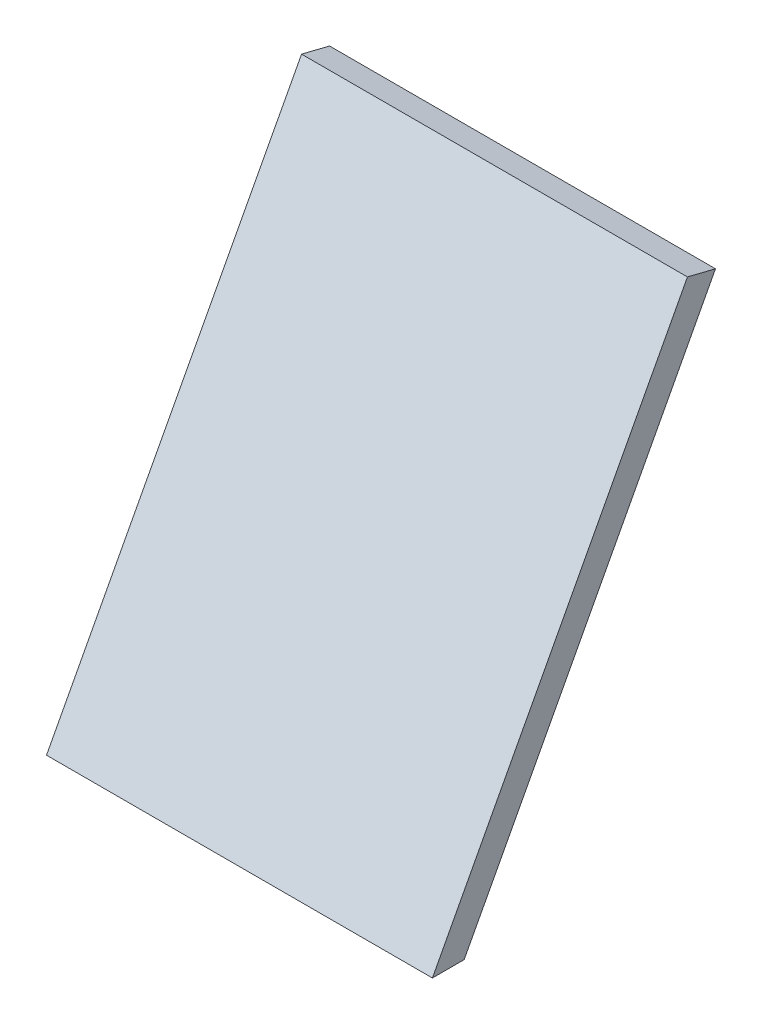
ISO-10303-21;
HEADER;
FILE_DESCRIPTION(('STEP AP214'),'2;1');
FILE_NAME('part.step','',(''),(''),'','','');
FILE_SCHEMA(('AUTOMOTIVE_DESIGN { 1 0 10303 214 1 1 1 1 }'));
ENDSEC;
DATA;
#1=APPLICATION_CONTEXT('core data for automotive mechanical design processes');
#2=APPLICATION_PROTOCOL_DEFINITION('international standard','automotive_design',2000,#1);
#3=PRODUCT_CONTEXT('',#1,'mechanical');
#4=PRODUCT('Part','Part','',(#3));
#5=PRODUCT_RELATED_PRODUCT_CATEGORY('part','',(#4));
#6=PRODUCT_DEFINITION_FORMATION('','',#4);
#7=PRODUCT_DEFINITION_CONTEXT('part definition',#1,'design');
#8=PRODUCT_DEFINITION('design','',#6,#7);
#9=PRODUCT_DEFINITION_SHAPE('','',#8);
#10=(LENGTH_UNIT() NAMED_UNIT(*) SI_UNIT(.MILLI.,.METRE.));
#11=(NAMED_UNIT(*) PLANE_ANGLE_UNIT() SI_UNIT($,.RADIAN.));
#12=(NAMED_UNIT(*) SI_UNIT($,.STERADIAN.) SOLID_ANGLE_UNIT());
#13=UNCERTAINTY_MEASURE_WITH_UNIT(LENGTH_MEASURE(1.E-05),#10,'distance_accuracy_value','');
#14=(GEOMETRIC_REPRESENTATION_CONTEXT(3) GLOBAL_UNCERTAINTY_ASSIGNED_CONTEXT((#13)) GLOBAL_UNIT_ASSIGNED_CONTEXT((#10,
#11,#12)) REPRESENTATION_CONTEXT('',''));
#15=CARTESIAN_POINT('',(0.,0.,0.));
#16=DIRECTION('',(0.,0.,1.));
#17=DIRECTION('',(1.,0.,0.));
#18=AXIS2_PLACEMENT_3D('',#15,#16,#17);
#19=CARTESIAN_POINT('',(43.66,106.923746647894,-143.154202423773));
#20=DIRECTION('',(0.,0.970295726275996,-0.24192189559967));
#21=DIRECTION('',(0.,0.24192189559967,0.970295726275996));
#22=AXIS2_PLACEMENT_3D('',#19,#20,#21);
#23=PLANE('',#22);
#24=DIRECTION('',(0.,-0.24192189559967,-0.970295726275996));
#25=VECTOR('',#24,1.);
#26=CARTESIAN_POINT('',(43.65,94.3012173907014,-193.780402101521));
#27=LINE('',#26,#25);
#28=CARTESIAN_POINT('',(43.65,108.506979465948,-136.804202423773));
#29=VERTEX_POINT('',#28);
#30=CARTESIAN_POINT('',(43.65,106.923746647894,-143.154202423773));
#31=VERTEX_POINT('',#30);
#32=EDGE_CURVE('E93',#29,#31,#27,.T.);
#33=ORIENTED_EDGE('',*,*,#32,.T.);
#34=DIRECTION('',(1.,0.,0.));
#35=VECTOR('',#34,1.);
#36=CARTESIAN_POINT('',(-50.,106.923746647894,-143.154202423773));
#37=LINE('',#36,#35);
#38=CARTESIAN_POINT('',(-43.65,106.923746647894,-143.154202423773));
#39=VERTEX_POINT('',#38);
#40=EDGE_CURVE('E38',#39,#31,#37,.T.);
#41=ORIENTED_EDGE('',*,*,#40,.F.);
#42=DIRECTION('',(0.,0.24192189559967,0.970295726275996));
#43=VECTOR('',#42,1.);
#44=CARTESIAN_POINT('',(-43.65,94.3012173907014,-193.780402101521));
#45=LINE('',#44,#43);
#46=CARTESIAN_POINT('',(-43.65,108.506979465948,-136.804202423773));
#47=VERTEX_POINT('',#46);
#48=EDGE_CURVE('E88',#39,#47,#45,.T.);
#49=ORIENTED_EDGE('',*,*,#48,.T.);
#50=DIRECTION('',(1.,0.,0.));
#51=VECTOR('',#50,1.);
#52=CARTESIAN_POINT('',(-50.,108.506979465948,-136.804202423773));
#53=LINE('',#52,#51);
#54=EDGE_CURVE('E96',#47,#29,#53,.T.);
#55=ORIENTED_EDGE('',*,*,#54,.T.);
#56=EDGE_LOOP('',(#33,#41,#49,#55));
#57=FACE_BOUND('',#56,.T.);
#58=ADVANCED_FACE('F34',(#57),#23,.T.);
#59=CARTESIAN_POINT('',(-43.65,-0.00999999999995449,-170.265974623788));
#60=DIRECTION('',(-1.,0.,0.));
#61=DIRECTION('',(0.,0.,-1.));
#62=AXIS2_PLACEMENT_3D('',#59,#60,#61);
#63=PLANE('',#62);
#64=DIRECTION('',(0.,0.882947592858925,-0.469471562785895));
#65=VECTOR('',#64,1.);
#66=CARTESIAN_POINT('',(-43.65,106.923746647894,-143.154202423773));
#67=LINE('',#66,#65);
#68=CARTESIAN_POINT('',(-43.65,0.,-86.3018378625049));
#69=VERTEX_POINT('',#68);
#70=EDGE_CURVE('E43',#69,#39,#67,.T.);
#71=ORIENTED_EDGE('',*,*,#70,.F.);
#72=DIRECTION('',(0.,0.,1.));
#73=VECTOR('',#72,1.);
#74=CARTESIAN_POINT('',(-43.65,0.,-143.164202423773));
#75=LINE('',#74,#73);
#76=CARTESIAN_POINT('',(-43.65,0.,-79.1100180406295));
#77=VERTEX_POINT('',#76);
#78=EDGE_CURVE('E99',#69,#77,#75,.T.);
#79=ORIENTED_EDGE('',*,*,#78,.T.);
#80=DIRECTION('',(0.,0.882947592858925,-0.469471562785895));
#81=VECTOR('',#80,1.);
#82=CARTESIAN_POINT('',(-43.65,-32.7925886605947,-61.6738893611958));
#83=LINE('',#82,#81);
#84=EDGE_CURVE('E90',#77,#47,#83,.T.);
#85=ORIENTED_EDGE('',*,*,#84,.T.);
#86=ORIENTED_EDGE('',*,*,#48,.F.);
#87=EDGE_LOOP('',(#71,#79,#85,#86));
#88=FACE_BOUND('',#87,.T.);
#89=ADVANCED_FACE('F36',(#88),#63,.T.);
#90=CARTESIAN_POINT('',(62.575,0.,-143.164202423773));
#91=DIRECTION('',(0.,-1.,0.));
#92=DIRECTION('',(-1.,0.,0.));
#93=AXIS2_PLACEMENT_3D('',#90,#91,#92);
#94=PLANE('',#93);
#95=DIRECTION('',(1.,0.,0.));
#96=VECTOR('',#95,1.);
#97=CARTESIAN_POINT('',(-50.,0.,-79.1100180406295));
#98=LINE('',#97,#96);
#99=CARTESIAN_POINT('',(43.65,0.,-79.1100180406295));
#100=VERTEX_POINT('',#99);
#101=EDGE_CURVE('E92',#77,#100,#98,.T.);
#102=ORIENTED_EDGE('',*,*,#101,.F.);
#103=ORIENTED_EDGE('',*,*,#78,.F.);
#104=DIRECTION('',(1.,0.,0.));
#105=VECTOR('',#104,1.);
#106=CARTESIAN_POINT('',(-50.,0.,-86.3018378625049));
#107=LINE('',#106,#105);
#108=CARTESIAN_POINT('',(43.65,0.,-86.3018378625049));
#109=VERTEX_POINT('',#108);
#110=EDGE_CURVE('E81',#69,#109,#107,.T.);
#111=ORIENTED_EDGE('',*,*,#110,.T.);
#112=DIRECTION('',(0.,0.,-1.));
#113=VECTOR('',#112,1.);
#114=CARTESIAN_POINT('',(43.65,0.,-143.164202423773));
#115=LINE('',#114,#113);
#116=EDGE_CURVE('E101',#100,#109,#115,.T.);
#117=ORIENTED_EDGE('',*,*,#116,.F.);
#118=EDGE_LOOP('',(#102,#103,#111,#117));
#119=FACE_BOUND('',#118,.T.);
#120=ADVANCED_FACE('F107',(#119),#94,.T.);
#121=CARTESIAN_POINT('',(43.65,-0.00999999999995449,-170.265974623788));
#122=DIRECTION('',(1.,0.,0.));
#123=DIRECTION('',(0.,0.,1.));
#124=AXIS2_PLACEMENT_3D('',#121,#122,#123);
#125=PLANE('',#124);
#126=DIRECTION('',(0.,0.882947592858925,-0.469471562785895));
#127=VECTOR('',#126,1.);
#128=CARTESIAN_POINT('',(43.65,-32.7925886605947,-61.6738893611958));
#129=LINE('',#128,#127);
#130=EDGE_CURVE('E11',#100,#29,#129,.T.);
#131=ORIENTED_EDGE('',*,*,#130,.F.);
#132=ORIENTED_EDGE('',*,*,#116,.T.);
#133=DIRECTION('',(0.,-0.882947592858925,0.469471562785895));
#134=VECTOR('',#133,1.);
#135=CARTESIAN_POINT('',(43.65,106.923746647894,-143.154202423773));
#136=LINE('',#135,#134);
#137=EDGE_CURVE('E85',#31,#109,#136,.T.);
#138=ORIENTED_EDGE('',*,*,#137,.F.);
#139=ORIENTED_EDGE('',*,*,#32,.F.);
#140=EDGE_LOOP('',(#131,#132,#138,#139));
#141=FACE_BOUND('',#140,.T.);
#142=ADVANCED_FACE('F105',(#141),#125,.T.);
#143=CARTESIAN_POINT('',(-50.,109.904891071585,-137.547485209119));
#144=DIRECTION('',(0.,0.469471562785895,0.882947592858925));
#145=DIRECTION('',(0.,-0.882947592858925,0.469471562785895));
#146=AXIS2_PLACEMENT_3D('',#143,#144,#145);
#147=PLANE('',#146);
#148=ORIENTED_EDGE('',*,*,#130,.T.);
#149=ORIENTED_EDGE('',*,*,#54,.F.);
#150=ORIENTED_EDGE('',*,*,#84,.F.);
#151=ORIENTED_EDGE('',*,*,#101,.T.);
#152=EDGE_LOOP('',(#148,#149,#150,#151));
#153=FACE_BOUND('',#152,.T.);
#154=ADVANCED_FACE('F108',(#153),#147,.T.);
#155=CARTESIAN_POINT('',(-50.,106.923746647894,-143.154202423773));
#156=DIRECTION('',(0.,0.469471562785895,0.882947592858925));
#157=DIRECTION('',(0.,-0.882947592858925,0.469471562785895));
#158=AXIS2_PLACEMENT_3D('',#155,#156,#157);
#159=PLANE('',#158);
#160=ORIENTED_EDGE('',*,*,#137,.T.);
#161=ORIENTED_EDGE('',*,*,#110,.F.);
#162=ORIENTED_EDGE('',*,*,#70,.T.);
#163=ORIENTED_EDGE('',*,*,#40,.T.);
#164=EDGE_LOOP('',(#160,#161,#162,#163));
#165=FACE_BOUND('',#164,.T.);
#166=ADVANCED_FACE('F77',(#165),#159,.F.);
#167=CLOSED_SHELL('',(#58,#89,#120,#142,#154,#166));
#168=MANIFOLD_SOLID_BREP('B2',#167);
#169=ADVANCED_BREP_SHAPE_REPRESENTATION('',(#18,#168),#14);
#170=SHAPE_DEFINITION_REPRESENTATION(#9,#169);
ENDSEC;
END-ISO-10303-21;
